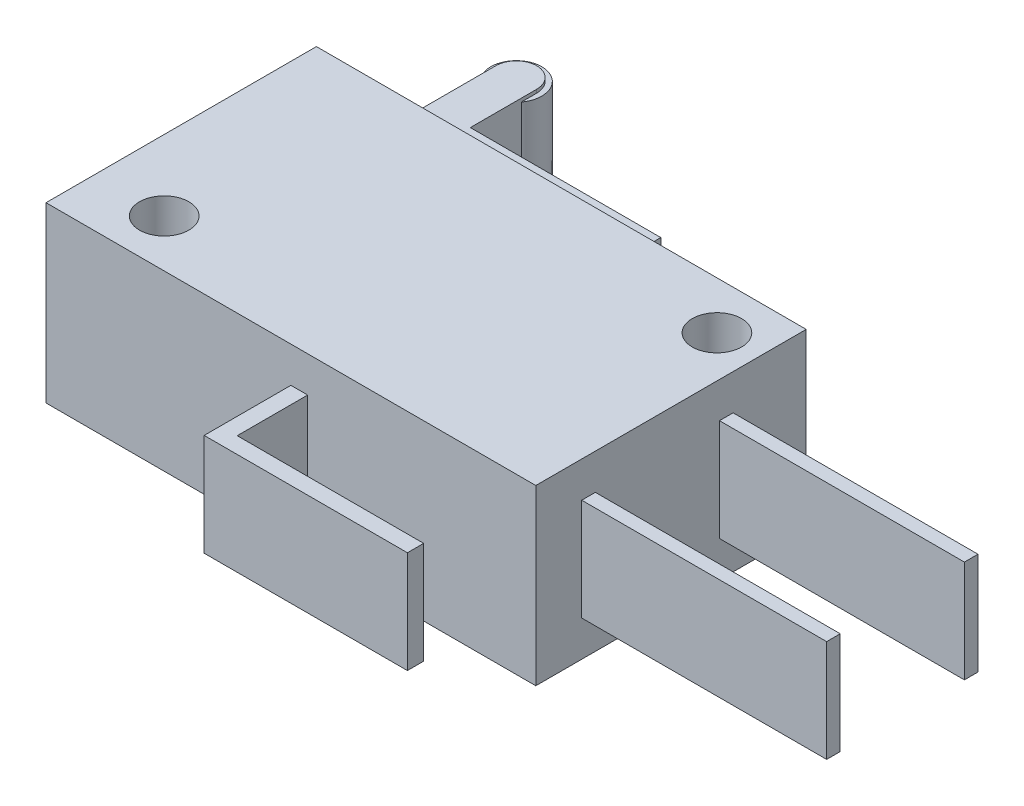
ISO-10303-21;
HEADER;
FILE_DESCRIPTION(('STEP AP214'),'2;1');
FILE_NAME('part.step','',(''),(''),'','','');
FILE_SCHEMA(('AUTOMOTIVE_DESIGN { 1 0 10303 214 1 1 1 1 }'));
ENDSEC;
DATA;
#1=APPLICATION_CONTEXT('core data for automotive mechanical design processes');
#2=APPLICATION_PROTOCOL_DEFINITION('international standard','automotive_design',2000,#1);
#3=PRODUCT_CONTEXT('',#1,'mechanical');
#4=PRODUCT('Part','Part','',(#3));
#5=PRODUCT_RELATED_PRODUCT_CATEGORY('part','',(#4));
#6=PRODUCT_DEFINITION_FORMATION('','',#4);
#7=PRODUCT_DEFINITION_CONTEXT('part definition',#1,'design');
#8=PRODUCT_DEFINITION('design','',#6,#7);
#9=PRODUCT_DEFINITION_SHAPE('','',#8);
#10=(LENGTH_UNIT() NAMED_UNIT(*) SI_UNIT(.MILLI.,.METRE.));
#11=(NAMED_UNIT(*) PLANE_ANGLE_UNIT() SI_UNIT($,.RADIAN.));
#12=(NAMED_UNIT(*) SI_UNIT($,.STERADIAN.) SOLID_ANGLE_UNIT());
#13=UNCERTAINTY_MEASURE_WITH_UNIT(LENGTH_MEASURE(1.E-05),#10,'distance_accuracy_value','');
#14=(GEOMETRIC_REPRESENTATION_CONTEXT(3) GLOBAL_UNCERTAINTY_ASSIGNED_CONTEXT((#13)) GLOBAL_UNIT_ASSIGNED_CONTEXT((#10,
#11,#12)) REPRESENTATION_CONTEXT('',''));
#15=CARTESIAN_POINT('',(0.,0.,0.));
#16=DIRECTION('',(0.,0.,1.));
#17=DIRECTION('',(1.,0.,0.));
#18=AXIS2_PLACEMENT_3D('',#15,#16,#17);
#19=CARTESIAN_POINT('',(-14.4,10.2,7.95));
#20=DIRECTION('',(0.,0.,-1.));
#21=DIRECTION('',(-1.,0.,0.));
#22=AXIS2_PLACEMENT_3D('',#19,#20,#21);
#23=PLANE('',#22);
#24=DIRECTION('',(1.,0.,0.));
#25=VECTOR('',#24,1.);
#26=CARTESIAN_POINT('',(-14.4,0.,7.95));
#27=LINE('',#26,#25);
#28=CARTESIAN_POINT('',(-14.4,0.,7.95));
#29=VERTEX_POINT('',#28);
#30=CARTESIAN_POINT('',(14.4,0.,7.95));
#31=VERTEX_POINT('',#30);
#32=EDGE_CURVE('E461',#29,#31,#27,.T.);
#33=ORIENTED_EDGE('',*,*,#32,.T.);
#34=DIRECTION('',(0.,-1.,0.));
#35=VECTOR('',#34,1.);
#36=CARTESIAN_POINT('',(14.4,10.2,7.95));
#37=LINE('',#36,#35);
#38=CARTESIAN_POINT('',(14.4,10.2,7.95));
#39=VERTEX_POINT('',#38);
#40=EDGE_CURVE('E470',#39,#31,#37,.T.);
#41=ORIENTED_EDGE('',*,*,#40,.F.);
#42=DIRECTION('',(1.,0.,0.));
#43=VECTOR('',#42,1.);
#44=CARTESIAN_POINT('',(-14.4,10.2,7.95));
#45=LINE('',#44,#43);
#46=CARTESIAN_POINT('',(-14.4,10.2,7.95));
#47=VERTEX_POINT('',#46);
#48=EDGE_CURVE('E448',#47,#39,#45,.T.);
#49=ORIENTED_EDGE('',*,*,#48,.F.);
#50=DIRECTION('',(0.,-1.,0.));
#51=VECTOR('',#50,1.);
#52=CARTESIAN_POINT('',(-14.4,10.2,7.95));
#53=LINE('',#52,#51);
#54=EDGE_CURVE('E468',#47,#29,#53,.T.);
#55=ORIENTED_EDGE('',*,*,#54,.T.);
#56=EDGE_LOOP('',(#33,#41,#49,#55));
#57=FACE_BOUND('',#56,.T.);
#58=DIRECTION('',(-1.,0.,0.));
#59=VECTOR('',#58,1.);
#60=CARTESIAN_POINT('',(0.986707235621526,2.1,7.95));
#61=LINE('',#60,#59);
#62=CARTESIAN_POINT('',(0.986707235621526,2.1,7.95));
#63=VERTEX_POINT('',#62);
#64=CARTESIAN_POINT('',(0.,2.1,7.95));
#65=VERTEX_POINT('',#64);
#66=EDGE_CURVE('E272',#63,#65,#61,.T.);
#67=ORIENTED_EDGE('',*,*,#66,.T.);
#68=DIRECTION('',(0.,1.,0.));
#69=VECTOR('',#68,1.);
#70=CARTESIAN_POINT('',(0.,2.1,7.95));
#71=LINE('',#70,#69);
#72=CARTESIAN_POINT('',(0.,8.1,7.95));
#73=VERTEX_POINT('',#72);
#74=EDGE_CURVE('E285',#65,#73,#71,.T.);
#75=ORIENTED_EDGE('',*,*,#74,.T.);
#76=DIRECTION('',(-1.,0.,0.));
#77=VECTOR('',#76,1.);
#78=CARTESIAN_POINT('',(0.986707235621526,8.1,7.95));
#79=LINE('',#78,#77);
#80=CARTESIAN_POINT('',(0.986707235621526,8.1,7.95));
#81=VERTEX_POINT('',#80);
#82=EDGE_CURVE('E261',#81,#73,#79,.T.);
#83=ORIENTED_EDGE('',*,*,#82,.F.);
#84=DIRECTION('',(0.,1.,0.));
#85=VECTOR('',#84,1.);
#86=CARTESIAN_POINT('',(0.986707235621526,2.1,7.95));
#87=LINE('',#86,#85);
#88=EDGE_CURVE('E288',#63,#81,#87,.T.);
#89=ORIENTED_EDGE('',*,*,#88,.F.);
#90=EDGE_LOOP('',(#67,#75,#83,#89));
#91=FACE_BOUND('',#90,.T.);
#92=ADVANCED_FACE('F37',(#57,#91),#23,.F.);
#93=CARTESIAN_POINT('',(14.4,10.2,7.95));
#94=DIRECTION('',(-1.,0.,0.));
#95=DIRECTION('',(0.,0.,1.));
#96=AXIS2_PLACEMENT_3D('',#93,#94,#95);
#97=PLANE('',#96);
#98=DIRECTION('',(0.,0.,-1.));
#99=VECTOR('',#98,1.);
#100=CARTESIAN_POINT('',(14.4,0.,7.95));
#101=LINE('',#100,#99);
#102=CARTESIAN_POINT('',(14.4,0.,-7.95));
#103=VERTEX_POINT('',#102);
#104=EDGE_CURVE('E457',#31,#103,#101,.T.);
#105=ORIENTED_EDGE('',*,*,#104,.T.);
#106=DIRECTION('',(0.,-1.,0.));
#107=VECTOR('',#106,1.);
#108=CARTESIAN_POINT('',(14.4,10.2,-7.95));
#109=LINE('',#108,#107);
#110=CARTESIAN_POINT('',(14.4,10.2,-7.95));
#111=VERTEX_POINT('',#110);
#112=EDGE_CURVE('E453',#111,#103,#109,.T.);
#113=ORIENTED_EDGE('',*,*,#112,.F.);
#114=DIRECTION('',(0.,0.,-1.));
#115=VECTOR('',#114,1.);
#116=CARTESIAN_POINT('',(14.4,10.2,7.95));
#117=LINE('',#116,#115);
#118=EDGE_CURVE('E445',#39,#111,#117,.T.);
#119=ORIENTED_EDGE('',*,*,#118,.F.);
#120=ORIENTED_EDGE('',*,*,#40,.T.);
#121=EDGE_LOOP('',(#105,#113,#119,#120));
#122=FACE_BOUND('',#121,.T.);
#123=DIRECTION('',(0.,1.,0.));
#124=VECTOR('',#123,1.);
#125=CARTESIAN_POINT('',(14.4,2.1,-3.65));
#126=LINE('',#125,#124);
#127=CARTESIAN_POINT('',(14.4,2.1,-3.65));
#128=VERTEX_POINT('',#127);
#129=CARTESIAN_POINT('',(14.4,8.1,-3.65));
#130=VERTEX_POINT('',#129);
#131=EDGE_CURVE('E343',#128,#130,#126,.T.);
#132=ORIENTED_EDGE('',*,*,#131,.F.);
#133=DIRECTION('',(0.,0.,1.));
#134=VECTOR('',#133,1.);
#135=CARTESIAN_POINT('',(14.4,2.1,-2.85));
#136=LINE('',#135,#134);
#137=CARTESIAN_POINT('',(14.4,2.1,-2.85));
#138=VERTEX_POINT('',#137);
#139=EDGE_CURVE('E331',#128,#138,#136,.T.);
#140=ORIENTED_EDGE('',*,*,#139,.T.);
#141=DIRECTION('',(0.,1.,0.));
#142=VECTOR('',#141,1.);
#143=CARTESIAN_POINT('',(14.4,2.1,-2.85));
#144=LINE('',#143,#142);
#145=CARTESIAN_POINT('',(14.4,8.1,-2.85));
#146=VERTEX_POINT('',#145);
#147=EDGE_CURVE('E342',#138,#146,#144,.T.);
#148=ORIENTED_EDGE('',*,*,#147,.T.);
#149=DIRECTION('',(0.,0.,1.));
#150=VECTOR('',#149,1.);
#151=CARTESIAN_POINT('',(14.4,8.1,-2.85));
#152=LINE('',#151,#150);
#153=EDGE_CURVE('E313',#130,#146,#152,.T.);
#154=ORIENTED_EDGE('',*,*,#153,.F.);
#155=EDGE_LOOP('',(#132,#140,#148,#154));
#156=FACE_BOUND('',#155,.T.);
#157=DIRECTION('',(0.,0.,1.));
#158=VECTOR('',#157,1.);
#159=CARTESIAN_POINT('',(14.4,2.1,4.45));
#160=LINE('',#159,#158);
#161=CARTESIAN_POINT('',(14.4,2.1,4.45));
#162=VERTEX_POINT('',#161);
#163=CARTESIAN_POINT('',(14.4,2.1,5.25));
#164=VERTEX_POINT('',#163);
#165=EDGE_CURVE('E298',#162,#164,#160,.T.);
#166=ORIENTED_EDGE('',*,*,#165,.T.);
#167=DIRECTION('',(0.,1.,0.));
#168=VECTOR('',#167,1.);
#169=CARTESIAN_POINT('',(14.4,2.1,5.25));
#170=LINE('',#169,#168);
#171=CARTESIAN_POINT('',(14.4,8.1,5.25));
#172=VERTEX_POINT('',#171);
#173=EDGE_CURVE('E310',#164,#172,#170,.T.);
#174=ORIENTED_EDGE('',*,*,#173,.T.);
#175=DIRECTION('',(0.,0.,1.));
#176=VECTOR('',#175,1.);
#177=CARTESIAN_POINT('',(14.4,8.1,4.45));
#178=LINE('',#177,#176);
#179=CARTESIAN_POINT('',(14.4,8.1,4.45));
#180=VERTEX_POINT('',#179);
#181=EDGE_CURVE('E282',#180,#172,#178,.T.);
#182=ORIENTED_EDGE('',*,*,#181,.F.);
#183=DIRECTION('',(0.,1.,0.));
#184=VECTOR('',#183,1.);
#185=CARTESIAN_POINT('',(14.4,2.1,4.45));
#186=LINE('',#185,#184);
#187=EDGE_CURVE('E311',#162,#180,#186,.T.);
#188=ORIENTED_EDGE('',*,*,#187,.F.);
#189=EDGE_LOOP('',(#166,#174,#182,#188));
#190=FACE_BOUND('',#189,.T.);
#191=ADVANCED_FACE('F542',(#122,#156,#190),#97,.F.);
#192=CARTESIAN_POINT('',(-8.65,1.7,-13.95));
#193=DIRECTION('',(0.,1.,0.));
#194=DIRECTION('',(0.,0.,1.));
#195=AXIS2_PLACEMENT_3D('',#192,#193,#194);
#196=CYLINDRICAL_SURFACE('',#195,1.2);
#197=DIRECTION('',(0.,1.,0.));
#198=VECTOR('',#197,1.);
#199=CARTESIAN_POINT('',(-9.85,1.7,-13.95));
#200=LINE('',#199,#198);
#201=CARTESIAN_POINT('',(-9.85,1.7,-13.95));
#202=VERTEX_POINT('',#201);
#203=CARTESIAN_POINT('',(-9.85,1.9,-13.95));
#204=VERTEX_POINT('',#203);
#205=EDGE_CURVE('E429',#202,#204,#200,.T.);
#206=ORIENTED_EDGE('',*,*,#205,.T.);
#207=CARTESIAN_POINT('',(-8.65,1.9,-13.95));
#208=DIRECTION('',(0.,1.,0.));
#209=DIRECTION('',(0.,0.,1.));
#210=AXIS2_PLACEMENT_3D('',#207,#208,#209);
#211=CIRCLE('',#210,1.2);
#212=CARTESIAN_POINT('',(-7.45,1.9,-13.95));
#213=VERTEX_POINT('',#212);
#214=EDGE_CURVE('E467',#204,#213,#211,.F.);
#215=ORIENTED_EDGE('',*,*,#214,.T.);
#216=DIRECTION('',(0.,1.,0.));
#217=VECTOR('',#216,1.);
#218=CARTESIAN_POINT('',(-7.45,1.7,-13.95));
#219=LINE('',#218,#217);
#220=CARTESIAN_POINT('',(-7.45,1.7,-13.95));
#221=VERTEX_POINT('',#220);
#222=EDGE_CURVE('E433',#221,#213,#219,.T.);
#223=ORIENTED_EDGE('',*,*,#222,.F.);
#224=CARTESIAN_POINT('',(-8.65,1.7,-13.95));
#225=DIRECTION('',(0.,1.,0.));
#226=DIRECTION('',(0.,0.,1.));
#227=AXIS2_PLACEMENT_3D('',#224,#225,#226);
#228=CIRCLE('',#227,1.2);
#229=EDGE_CURVE('E395',#221,#202,#228,.T.);
#230=ORIENTED_EDGE('',*,*,#229,.T.);
#231=EDGE_LOOP('',(#206,#215,#223,#230));
#232=FACE_BOUND('',#231,.T.);
#233=ADVANCED_FACE('F510',(#232),#196,.T.);
#234=CARTESIAN_POINT('',(-14.4,10.2,-7.95));
#235=DIRECTION('',(0.,0.,-1.));
#236=DIRECTION('',(-1.,0.,0.));
#237=AXIS2_PLACEMENT_3D('',#234,#235,#236);
#238=PLANE('',#237);
#239=DIRECTION('',(1.,0.,0.));
#240=VECTOR('',#239,1.);
#241=CARTESIAN_POINT('',(-14.4,0.,-7.95));
#242=LINE('',#241,#240);
#243=CARTESIAN_POINT('',(-14.4,0.,-7.95));
#244=VERTEX_POINT('',#243);
#245=EDGE_CURVE('E454',#244,#103,#242,.T.);
#246=ORIENTED_EDGE('',*,*,#245,.F.);
#247=DIRECTION('',(0.,-1.,0.));
#248=VECTOR('',#247,1.);
#249=CARTESIAN_POINT('',(-14.4,10.2,-7.95));
#250=LINE('',#249,#248);
#251=CARTESIAN_POINT('',(-14.4,10.2,-7.95));
#252=VERTEX_POINT('',#251);
#253=EDGE_CURVE('E465',#252,#244,#250,.T.);
#254=ORIENTED_EDGE('',*,*,#253,.F.);
#255=DIRECTION('',(1.,0.,0.));
#256=VECTOR('',#255,1.);
#257=CARTESIAN_POINT('',(-14.4,10.2,-7.95));
#258=LINE('',#257,#256);
#259=EDGE_CURVE('E442',#252,#111,#258,.T.);
#260=ORIENTED_EDGE('',*,*,#259,.T.);
#261=ORIENTED_EDGE('',*,*,#112,.T.);
#262=EDGE_LOOP('',(#246,#254,#260,#261));
#263=FACE_BOUND('',#262,.T.);
#264=DIRECTION('',(0.,1.,0.));
#265=VECTOR('',#264,1.);
#266=CARTESIAN_POINT('',(3.23890030456619,1.7,-7.95));
#267=LINE('',#266,#265);
#268=CARTESIAN_POINT('',(3.23890030456619,1.7,-7.95));
#269=VERTEX_POINT('',#268);
#270=CARTESIAN_POINT('',(3.23890030456619,8.5,-7.95));
#271=VERTEX_POINT('',#270);
#272=EDGE_CURVE('E422',#269,#271,#267,.T.);
#273=ORIENTED_EDGE('',*,*,#272,.F.);
#274=DIRECTION('',(-1.,0.,0.));
#275=VECTOR('',#274,1.);
#276=CARTESIAN_POINT('',(0.,1.7,-7.95));
#277=LINE('',#276,#275);
#278=CARTESIAN_POINT('',(3.75,1.7,-7.95));
#279=VERTEX_POINT('',#278);
#280=EDGE_CURVE('E406',#279,#269,#277,.T.);
#281=ORIENTED_EDGE('',*,*,#280,.F.);
#282=DIRECTION('',(0.,1.,0.));
#283=VECTOR('',#282,1.);
#284=CARTESIAN_POINT('',(3.75,1.7,-7.95));
#285=LINE('',#284,#283);
#286=CARTESIAN_POINT('',(3.75,8.5,-7.95));
#287=VERTEX_POINT('',#286);
#288=EDGE_CURVE('E420',#279,#287,#285,.T.);
#289=ORIENTED_EDGE('',*,*,#288,.T.);
#290=DIRECTION('',(-1.,0.,0.));
#291=VECTOR('',#290,1.);
#292=CARTESIAN_POINT('',(0.,8.5,-7.95));
#293=LINE('',#292,#291);
#294=EDGE_CURVE('E384',#287,#271,#293,.T.);
#295=ORIENTED_EDGE('',*,*,#294,.T.);
#296=EDGE_LOOP('',(#273,#281,#289,#295));
#297=FACE_BOUND('',#296,.T.);
#298=ADVANCED_FACE('F39',(#263,#297),#238,.T.);
#299=CARTESIAN_POINT('',(-14.4,10.2,7.95));
#300=DIRECTION('',(-1.,0.,0.));
#301=DIRECTION('',(0.,0.,1.));
#302=AXIS2_PLACEMENT_3D('',#299,#300,#301);
#303=PLANE('',#302);
#304=DIRECTION('',(0.,0.,-1.));
#305=VECTOR('',#304,1.);
#306=CARTESIAN_POINT('',(-14.4,0.,7.95));
#307=LINE('',#306,#305);
#308=EDGE_CURVE('E446',#29,#244,#307,.T.);
#309=ORIENTED_EDGE('',*,*,#308,.F.);
#310=ORIENTED_EDGE('',*,*,#54,.F.);
#311=DIRECTION('',(0.,0.,-1.));
#312=VECTOR('',#311,1.);
#313=CARTESIAN_POINT('',(-14.4,10.2,7.95));
#314=LINE('',#313,#312);
#315=EDGE_CURVE('E450',#47,#252,#314,.T.);
#316=ORIENTED_EDGE('',*,*,#315,.T.);
#317=ORIENTED_EDGE('',*,*,#253,.T.);
#318=EDGE_LOOP('',(#309,#310,#316,#317));
#319=FACE_BOUND('',#318,.T.);
#320=ADVANCED_FACE('F533',(#319),#303,.T.);
#321=CARTESIAN_POINT('',(0.,10.2,0.));
#322=DIRECTION('',(0.,1.,0.));
#323=DIRECTION('',(0.,0.,1.));
#324=AXIS2_PLACEMENT_3D('',#321,#322,#323);
#325=PLANE('',#324);
#326=CARTESIAN_POINT('',(11.95,10.2,-5.15));
#327=DIRECTION('',(0.,1.,0.));
#328=DIRECTION('',(0.,0.,1.));
#329=AXIS2_PLACEMENT_3D('',#326,#327,#328);
#330=CIRCLE('',#329,1.45);
#331=CARTESIAN_POINT('',(11.95,10.2,-3.7));
#332=VERTEX_POINT('',#331);
#333=EDGE_CURVE('E436',#332,#332,#330,.T.);
#334=ORIENTED_EDGE('',*,*,#333,.F.);
#335=EDGE_LOOP('',(#334));
#336=FACE_BOUND('',#335,.T.);
#337=CARTESIAN_POINT('',(-10.25,10.2,5.15));
#338=DIRECTION('',(0.,1.,0.));
#339=DIRECTION('',(0.,0.,1.));
#340=AXIS2_PLACEMENT_3D('',#337,#338,#339);
#341=CIRCLE('',#340,1.45);
#342=CARTESIAN_POINT('',(-10.25,10.2,6.6));
#343=VERTEX_POINT('',#342);
#344=EDGE_CURVE('E417',#343,#343,#341,.T.);
#345=ORIENTED_EDGE('',*,*,#344,.F.);
#346=EDGE_LOOP('',(#345));
#347=FACE_BOUND('',#346,.T.);
#348=ORIENTED_EDGE('',*,*,#259,.F.);
#349=ORIENTED_EDGE('',*,*,#315,.F.);
#350=ORIENTED_EDGE('',*,*,#48,.T.);
#351=ORIENTED_EDGE('',*,*,#118,.T.);
#352=EDGE_LOOP('',(#348,#349,#350,#351));
#353=FACE_BOUND('',#352,.T.);
#354=ADVANCED_FACE('F539',(#336,#347,#353),#325,.T.);
#355=CARTESIAN_POINT('',(0.,0.,0.));
#356=DIRECTION('',(0.,1.,0.));
#357=DIRECTION('',(0.,0.,1.));
#358=AXIS2_PLACEMENT_3D('',#355,#356,#357);
#359=PLANE('',#358);
#360=CARTESIAN_POINT('',(11.95,0.,-5.15));
#361=DIRECTION('',(0.,1.,0.));
#362=DIRECTION('',(0.,0.,1.));
#363=AXIS2_PLACEMENT_3D('',#360,#361,#362);
#364=CIRCLE('',#363,1.45);
#365=CARTESIAN_POINT('',(11.95,0.,-3.7));
#366=VERTEX_POINT('',#365);
#367=EDGE_CURVE('E458',#366,#366,#364,.T.);
#368=ORIENTED_EDGE('',*,*,#367,.T.);
#369=EDGE_LOOP('',(#368));
#370=FACE_BOUND('',#369,.T.);
#371=CARTESIAN_POINT('',(-10.25,0.,5.15));
#372=DIRECTION('',(0.,1.,0.));
#373=DIRECTION('',(0.,0.,1.));
#374=AXIS2_PLACEMENT_3D('',#371,#372,#373);
#375=CIRCLE('',#374,1.45);
#376=CARTESIAN_POINT('',(-10.25,0.,6.6));
#377=VERTEX_POINT('',#376);
#378=EDGE_CURVE('E439',#377,#377,#375,.T.);
#379=ORIENTED_EDGE('',*,*,#378,.T.);
#380=EDGE_LOOP('',(#379));
#381=FACE_BOUND('',#380,.T.);
#382=ORIENTED_EDGE('',*,*,#245,.T.);
#383=ORIENTED_EDGE('',*,*,#104,.F.);
#384=ORIENTED_EDGE('',*,*,#32,.F.);
#385=ORIENTED_EDGE('',*,*,#308,.T.);
#386=EDGE_LOOP('',(#382,#383,#384,#385));
#387=FACE_BOUND('',#386,.T.);
#388=ADVANCED_FACE('F554',(#370,#381,#387),#359,.F.);
#389=CARTESIAN_POINT('',(-10.25,-7.25,5.15));
#390=DIRECTION('',(0.,1.,0.));
#391=DIRECTION('',(0.,0.,1.));
#392=AXIS2_PLACEMENT_3D('',#389,#390,#391);
#393=CYLINDRICAL_SURFACE('',#392,1.45);
#394=ORIENTED_EDGE('',*,*,#344,.T.);
#395=EDGE_LOOP('',(#394));
#396=FACE_BOUND('',#395,.T.);
#397=ORIENTED_EDGE('',*,*,#378,.F.);
#398=EDGE_LOOP('',(#397));
#399=FACE_BOUND('',#398,.T.);
#400=ADVANCED_FACE('F557',(#396,#399),#393,.F.);
#401=CARTESIAN_POINT('',(11.95,-7.25,-5.15));
#402=DIRECTION('',(0.,1.,0.));
#403=DIRECTION('',(0.,0.,1.));
#404=AXIS2_PLACEMENT_3D('',#401,#402,#403);
#405=CYLINDRICAL_SURFACE('',#404,1.45);
#406=ORIENTED_EDGE('',*,*,#333,.T.);
#407=EDGE_LOOP('',(#406));
#408=FACE_BOUND('',#407,.T.);
#409=ORIENTED_EDGE('',*,*,#367,.F.);
#410=EDGE_LOOP('',(#409));
#411=FACE_BOUND('',#410,.T.);
#412=ADVANCED_FACE('F564',(#408,#411),#405,.F.);
#413=CARTESIAN_POINT('',(-7.45,1.7,0.));
#414=DIRECTION('',(-1.,0.,0.));
#415=DIRECTION('',(0.,0.,1.));
#416=AXIS2_PLACEMENT_3D('',#413,#414,#415);
#417=PLANE('',#416);
#418=DIRECTION('',(0.,-1.,0.));
#419=VECTOR('',#418,1.);
#420=CARTESIAN_POINT('',(-7.45,8.3,-13.05));
#421=LINE('',#420,#419);
#422=CARTESIAN_POINT('',(-7.45,8.3,-13.05));
#423=VERTEX_POINT('',#422);
#424=CARTESIAN_POINT('',(-7.45,1.9,-13.05));
#425=VERTEX_POINT('',#424);
#426=EDGE_CURVE('E367',#423,#425,#421,.T.);
#427=ORIENTED_EDGE('',*,*,#426,.F.);
#428=DIRECTION('',(0.,0.,-1.));
#429=VECTOR('',#428,1.);
#430=CARTESIAN_POINT('',(-7.45,8.3,0.));
#431=LINE('',#430,#429);
#432=CARTESIAN_POINT('',(-7.45,8.3,-13.95));
#433=VERTEX_POINT('',#432);
#434=EDGE_CURVE('E364',#423,#433,#431,.T.);
#435=ORIENTED_EDGE('',*,*,#434,.T.);
#436=CARTESIAN_POINT('',(-7.45,8.5,-13.95));
#437=VERTEX_POINT('',#436);
#438=EDGE_CURVE('E414',#433,#437,#219,.T.);
#439=ORIENTED_EDGE('',*,*,#438,.T.);
#440=DIRECTION('',(0.,0.,1.));
#441=VECTOR('',#440,1.);
#442=CARTESIAN_POINT('',(-7.45,8.5,0.));
#443=LINE('',#442,#441);
#444=CARTESIAN_POINT('',(-7.45,8.5,-10.05));
#445=VERTEX_POINT('',#444);
#446=EDGE_CURVE('E369',#437,#445,#443,.T.);
#447=ORIENTED_EDGE('',*,*,#446,.T.);
#448=DIRECTION('',(0.,1.,0.));
#449=VECTOR('',#448,1.);
#450=CARTESIAN_POINT('',(-7.45,1.7,-10.05));
#451=LINE('',#450,#449);
#452=CARTESIAN_POINT('',(-7.45,1.7,-10.05));
#453=VERTEX_POINT('',#452);
#454=EDGE_CURVE('E415',#453,#445,#451,.T.);
#455=ORIENTED_EDGE('',*,*,#454,.F.);
#456=DIRECTION('',(0.,0.,1.));
#457=VECTOR('',#456,1.);
#458=CARTESIAN_POINT('',(-7.45,1.7,0.));
#459=LINE('',#458,#457);
#460=EDGE_CURVE('E392',#221,#453,#459,.T.);
#461=ORIENTED_EDGE('',*,*,#460,.F.);
#462=ORIENTED_EDGE('',*,*,#222,.T.);
#463=DIRECTION('',(0.,0.,-1.));
#464=VECTOR('',#463,1.);
#465=CARTESIAN_POINT('',(-7.45,1.9,0.));
#466=LINE('',#465,#464);
#467=EDGE_CURVE('E360',#425,#213,#466,.T.);
#468=ORIENTED_EDGE('',*,*,#467,.F.);
#469=EDGE_LOOP('',(#427,#435,#439,#447,#455,#461,#462,#468));
#470=FACE_BOUND('',#469,.T.);
#471=ADVANCED_FACE('F489',(#470),#417,.F.);
#472=CARTESIAN_POINT('',(0.,1.7,-10.05));
#473=DIRECTION('',(0.,0.,1.));
#474=DIRECTION('',(1.,0.,0.));
#475=AXIS2_PLACEMENT_3D('',#472,#473,#474);
#476=PLANE('',#475);
#477=ORIENTED_EDGE('',*,*,#454,.T.);
#478=DIRECTION('',(1.,0.,0.));
#479=VECTOR('',#478,1.);
#480=CARTESIAN_POINT('',(0.,8.5,-10.05));
#481=LINE('',#480,#479);
#482=CARTESIAN_POINT('',(3.75,8.5,-10.05));
#483=VERTEX_POINT('',#482);
#484=EDGE_CURVE('E389',#445,#483,#481,.T.);
#485=ORIENTED_EDGE('',*,*,#484,.T.);
#486=DIRECTION('',(0.,1.,0.));
#487=VECTOR('',#486,1.);
#488=CARTESIAN_POINT('',(3.75,1.7,-10.05));
#489=LINE('',#488,#487);
#490=CARTESIAN_POINT('',(3.75,1.7,-10.05));
#491=VERTEX_POINT('',#490);
#492=EDGE_CURVE('E418',#491,#483,#489,.T.);
#493=ORIENTED_EDGE('',*,*,#492,.F.);
#494=DIRECTION('',(1.,0.,0.));
#495=VECTOR('',#494,1.);
#496=CARTESIAN_POINT('',(0.,1.7,-10.05));
#497=LINE('',#496,#495);
#498=EDGE_CURVE('E412',#453,#491,#497,.T.);
#499=ORIENTED_EDGE('',*,*,#498,.F.);
#500=EDGE_LOOP('',(#477,#485,#493,#499));
#501=FACE_BOUND('',#500,.T.);
#502=ADVANCED_FACE('F503',(#501),#476,.F.);
#503=CARTESIAN_POINT('',(3.75,1.7,0.));
#504=DIRECTION('',(-1.,0.,0.));
#505=DIRECTION('',(0.,0.,1.));
#506=AXIS2_PLACEMENT_3D('',#503,#504,#505);
#507=PLANE('',#506);
#508=ORIENTED_EDGE('',*,*,#492,.T.);
#509=DIRECTION('',(0.,0.,1.));
#510=VECTOR('',#509,1.);
#511=CARTESIAN_POINT('',(3.75,8.5,0.));
#512=LINE('',#511,#510);
#513=EDGE_CURVE('E386',#483,#287,#512,.T.);
#514=ORIENTED_EDGE('',*,*,#513,.T.);
#515=ORIENTED_EDGE('',*,*,#288,.F.);
#516=DIRECTION('',(0.,0.,1.));
#517=VECTOR('',#516,1.);
#518=CARTESIAN_POINT('',(3.75,1.7,0.));
#519=LINE('',#518,#517);
#520=EDGE_CURVE('E409',#491,#279,#519,.T.);
#521=ORIENTED_EDGE('',*,*,#520,.F.);
#522=EDGE_LOOP('',(#508,#514,#515,#521));
#523=FACE_BOUND('',#522,.T.);
#524=ADVANCED_FACE('F531',(#523),#507,.F.);
#525=CARTESIAN_POINT('',(3.2389003045662,1.7,0.));
#526=DIRECTION('',(-1.,0.,0.));
#527=DIRECTION('',(0.,0.,1.));
#528=AXIS2_PLACEMENT_3D('',#525,#526,#527);
#529=PLANE('',#528);
#530=ORIENTED_EDGE('',*,*,#272,.T.);
#531=DIRECTION('',(0.,0.,1.));
#532=VECTOR('',#531,1.);
#533=CARTESIAN_POINT('',(3.2389003045662,8.5,0.));
#534=LINE('',#533,#532);
#535=CARTESIAN_POINT('',(3.23890030456619,8.5,-9.64893386783168));
#536=VERTEX_POINT('',#535);
#537=EDGE_CURVE('E381',#536,#271,#534,.T.);
#538=ORIENTED_EDGE('',*,*,#537,.F.);
#539=DIRECTION('',(0.,1.,0.));
#540=VECTOR('',#539,1.);
#541=CARTESIAN_POINT('',(3.23890030456619,1.7,-9.64893386783168));
#542=LINE('',#541,#540);
#543=CARTESIAN_POINT('',(3.23890030456619,1.7,-9.64893386783168));
#544=VERTEX_POINT('',#543);
#545=EDGE_CURVE('E425',#544,#536,#542,.T.);
#546=ORIENTED_EDGE('',*,*,#545,.F.);
#547=DIRECTION('',(0.,0.,1.));
#548=VECTOR('',#547,1.);
#549=CARTESIAN_POINT('',(3.2389003045662,1.7,0.));
#550=LINE('',#549,#548);
#551=EDGE_CURVE('E403',#544,#269,#550,.T.);
#552=ORIENTED_EDGE('',*,*,#551,.T.);
#553=EDGE_LOOP('',(#530,#538,#546,#552));
#554=FACE_BOUND('',#553,.T.);
#555=ADVANCED_FACE('F526',(#554),#529,.T.);
#556=CARTESIAN_POINT('',(0.,1.7,-9.64893386783168));
#557=DIRECTION('',(0.,0.,-1.));
#558=DIRECTION('',(-1.,0.,0.));
#559=AXIS2_PLACEMENT_3D('',#556,#557,#558);
#560=PLANE('',#559);
#561=ORIENTED_EDGE('',*,*,#545,.T.);
#562=DIRECTION('',(-1.,0.,0.));
#563=VECTOR('',#562,1.);
#564=CARTESIAN_POINT('',(0.,8.5,-9.64893386783168));
#565=LINE('',#564,#563);
#566=CARTESIAN_POINT('',(-9.85,8.5,-9.64893386783168));
#567=VERTEX_POINT('',#566);
#568=EDGE_CURVE('E378',#536,#567,#565,.T.);
#569=ORIENTED_EDGE('',*,*,#568,.T.);
#570=DIRECTION('',(0.,1.,0.));
#571=VECTOR('',#570,1.);
#572=CARTESIAN_POINT('',(-9.85,1.7,-9.64893386783168));
#573=LINE('',#572,#571);
#574=CARTESIAN_POINT('',(-9.85,1.7,-9.64893386783168));
#575=VERTEX_POINT('',#574);
#576=EDGE_CURVE('E427',#575,#567,#573,.T.);
#577=ORIENTED_EDGE('',*,*,#576,.F.);
#578=DIRECTION('',(-1.,0.,0.));
#579=VECTOR('',#578,1.);
#580=CARTESIAN_POINT('',(0.,1.7,-9.64893386783168));
#581=LINE('',#580,#579);
#582=EDGE_CURVE('E401',#544,#575,#581,.T.);
#583=ORIENTED_EDGE('',*,*,#582,.F.);
#584=EDGE_LOOP('',(#561,#569,#577,#583));
#585=FACE_BOUND('',#584,.T.);
#586=ADVANCED_FACE('F521',(#585),#560,.F.);
#587=CARTESIAN_POINT('',(-9.85,1.7,0.));
#588=DIRECTION('',(-1.,0.,0.));
#589=DIRECTION('',(0.,0.,1.));
#590=AXIS2_PLACEMENT_3D('',#587,#588,#589);
#591=PLANE('',#590);
#592=DIRECTION('',(0.,0.,-1.));
#593=VECTOR('',#592,1.);
#594=CARTESIAN_POINT('',(-9.85,8.3,0.));
#595=LINE('',#594,#593);
#596=CARTESIAN_POINT('',(-9.85,8.3,-13.05));
#597=VERTEX_POINT('',#596);
#598=CARTESIAN_POINT('',(-9.85,8.3,-13.95));
#599=VERTEX_POINT('',#598);
#600=EDGE_CURVE('E362',#597,#599,#595,.T.);
#601=ORIENTED_EDGE('',*,*,#600,.F.);
#602=DIRECTION('',(0.,-1.,0.));
#603=VECTOR('',#602,1.);
#604=CARTESIAN_POINT('',(-9.85,8.3,-13.05));
#605=LINE('',#604,#603);
#606=CARTESIAN_POINT('',(-9.85,1.9,-13.05));
#607=VERTEX_POINT('',#606);
#608=EDGE_CURVE('E11',#597,#607,#605,.T.);
#609=ORIENTED_EDGE('',*,*,#608,.T.);
#610=DIRECTION('',(0.,0.,-1.));
#611=VECTOR('',#610,1.);
#612=CARTESIAN_POINT('',(-9.85,1.9,0.));
#613=LINE('',#612,#611);
#614=EDGE_CURVE('E357',#607,#204,#613,.T.);
#615=ORIENTED_EDGE('',*,*,#614,.T.);
#616=ORIENTED_EDGE('',*,*,#205,.F.);
#617=DIRECTION('',(0.,0.,1.));
#618=VECTOR('',#617,1.);
#619=CARTESIAN_POINT('',(-9.85,1.7,0.));
#620=LINE('',#619,#618);
#621=EDGE_CURVE('E398',#202,#575,#620,.T.);
#622=ORIENTED_EDGE('',*,*,#621,.T.);
#623=ORIENTED_EDGE('',*,*,#576,.T.);
#624=DIRECTION('',(0.,0.,1.));
#625=VECTOR('',#624,1.);
#626=CARTESIAN_POINT('',(-9.85,8.5,0.));
#627=LINE('',#626,#625);
#628=CARTESIAN_POINT('',(-9.85,8.5,-13.95));
#629=VERTEX_POINT('',#628);
#630=EDGE_CURVE('E375',#629,#567,#627,.T.);
#631=ORIENTED_EDGE('',*,*,#630,.F.);
#632=EDGE_CURVE('E432',#599,#629,#200,.T.);
#633=ORIENTED_EDGE('',*,*,#632,.F.);
#634=EDGE_LOOP('',(#601,#609,#615,#616,#622,#623,#631,#633));
#635=FACE_BOUND('',#634,.T.);
#636=ADVANCED_FACE('F517',(#635),#591,.T.);
#637=CARTESIAN_POINT('',(-8.65,8.3,-13.95));
#638=DIRECTION('',(0.,1.,0.));
#639=DIRECTION('',(0.,0.,1.));
#640=AXIS2_PLACEMENT_3D('',#637,#638,#639);
#641=CIRCLE('',#640,1.2);
#642=EDGE_CURVE('E45',#599,#433,#641,.F.);
#643=ORIENTED_EDGE('',*,*,#642,.F.);
#644=ORIENTED_EDGE('',*,*,#632,.T.);
#645=CARTESIAN_POINT('',(-8.65,8.5,-13.95));
#646=DIRECTION('',(0.,1.,0.));
#647=DIRECTION('',(0.,0.,1.));
#648=AXIS2_PLACEMENT_3D('',#645,#646,#647);
#649=CIRCLE('',#648,1.2);
#650=EDGE_CURVE('E372',#437,#629,#649,.T.);
#651=ORIENTED_EDGE('',*,*,#650,.F.);
#652=ORIENTED_EDGE('',*,*,#438,.F.);
#653=EDGE_LOOP('',(#643,#644,#651,#652));
#654=FACE_BOUND('',#653,.T.);
#655=ADVANCED_FACE('F492',(#654),#196,.T.);
#656=CARTESIAN_POINT('',(0.,1.7,0.));
#657=DIRECTION('',(0.,1.,0.));
#658=DIRECTION('',(0.,0.,1.));
#659=AXIS2_PLACEMENT_3D('',#656,#657,#658);
#660=PLANE('',#659);
#661=ORIENTED_EDGE('',*,*,#460,.T.);
#662=ORIENTED_EDGE('',*,*,#498,.T.);
#663=ORIENTED_EDGE('',*,*,#520,.T.);
#664=ORIENTED_EDGE('',*,*,#280,.T.);
#665=ORIENTED_EDGE('',*,*,#551,.F.);
#666=ORIENTED_EDGE('',*,*,#582,.T.);
#667=ORIENTED_EDGE('',*,*,#621,.F.);
#668=ORIENTED_EDGE('',*,*,#229,.F.);
#669=EDGE_LOOP('',(#661,#662,#663,#664,#665,#666,#667,#668));
#670=FACE_BOUND('',#669,.T.);
#671=ADVANCED_FACE('F507',(#670),#660,.F.);
#672=CARTESIAN_POINT('',(0.,8.5,0.));
#673=DIRECTION('',(0.,1.,0.));
#674=DIRECTION('',(0.,0.,1.));
#675=AXIS2_PLACEMENT_3D('',#672,#673,#674);
#676=PLANE('',#675);
#677=ORIENTED_EDGE('',*,*,#446,.F.);
#678=ORIENTED_EDGE('',*,*,#650,.T.);
#679=ORIENTED_EDGE('',*,*,#630,.T.);
#680=ORIENTED_EDGE('',*,*,#568,.F.);
#681=ORIENTED_EDGE('',*,*,#537,.T.);
#682=ORIENTED_EDGE('',*,*,#294,.F.);
#683=ORIENTED_EDGE('',*,*,#513,.F.);
#684=ORIENTED_EDGE('',*,*,#484,.F.);
#685=EDGE_LOOP('',(#677,#678,#679,#680,#681,#682,#683,#684));
#686=FACE_BOUND('',#685,.T.);
#687=ADVANCED_FACE('F497',(#686),#676,.T.);
#688=CARTESIAN_POINT('',(-8.65,8.3,-13.95));
#689=DIRECTION('',(0.,-1.,0.));
#690=DIRECTION('',(0.,0.,-1.));
#691=AXIS2_PLACEMENT_3D('',#688,#689,#690);
#692=CYLINDRICAL_SURFACE('',#691,1.5);
#693=CARTESIAN_POINT('',(-8.65,8.3,-13.95));
#694=DIRECTION('',(0.,1.,0.));
#695=DIRECTION('',(0.,0.,1.));
#696=AXIS2_PLACEMENT_3D('',#693,#694,#695);
#697=CIRCLE('',#696,1.5);
#698=EDGE_CURVE('E354',#423,#597,#697,.T.);
#699=ORIENTED_EDGE('',*,*,#698,.F.);
#700=ORIENTED_EDGE('',*,*,#426,.T.);
#701=CARTESIAN_POINT('',(-8.65,1.9,-13.95));
#702=DIRECTION('',(0.,1.,0.));
#703=DIRECTION('',(0.,0.,1.));
#704=AXIS2_PLACEMENT_3D('',#701,#702,#703);
#705=CIRCLE('',#704,1.5);
#706=EDGE_CURVE('E346',#425,#607,#705,.T.);
#707=ORIENTED_EDGE('',*,*,#706,.T.);
#708=ORIENTED_EDGE('',*,*,#608,.F.);
#709=EDGE_LOOP('',(#699,#700,#707,#708));
#710=FACE_BOUND('',#709,.T.);
#711=ADVANCED_FACE('F515',(#710),#692,.T.);
#712=CARTESIAN_POINT('',(-8.65,8.3,-13.95));
#713=DIRECTION('',(0.,1.,0.));
#714=DIRECTION('',(0.,0.,1.));
#715=AXIS2_PLACEMENT_3D('',#712,#713,#714);
#716=PLANE('',#715);
#717=ORIENTED_EDGE('',*,*,#434,.F.);
#718=ORIENTED_EDGE('',*,*,#698,.T.);
#719=ORIENTED_EDGE('',*,*,#600,.T.);
#720=ORIENTED_EDGE('',*,*,#642,.T.);
#721=EDGE_LOOP('',(#717,#718,#719,#720));
#722=FACE_BOUND('',#721,.T.);
#723=ADVANCED_FACE('F481',(#722),#716,.T.);
#724=CARTESIAN_POINT('',(-8.65,1.9,-13.95));
#725=DIRECTION('',(0.,1.,0.));
#726=DIRECTION('',(0.,0.,1.));
#727=AXIS2_PLACEMENT_3D('',#724,#725,#726);
#728=PLANE('',#727);
#729=ORIENTED_EDGE('',*,*,#706,.F.);
#730=ORIENTED_EDGE('',*,*,#467,.T.);
#731=ORIENTED_EDGE('',*,*,#214,.F.);
#732=ORIENTED_EDGE('',*,*,#614,.F.);
#733=EDGE_LOOP('',(#729,#730,#731,#732));
#734=FACE_BOUND('',#733,.T.);
#735=ADVANCED_FACE('F513',(#734),#728,.F.);
#736=CARTESIAN_POINT('',(14.4,2.1,-3.65));
#737=DIRECTION('',(0.,0.,-1.));
#738=DIRECTION('',(-1.,0.,0.));
#739=AXIS2_PLACEMENT_3D('',#736,#737,#738);
#740=PLANE('',#739);
#741=ORIENTED_EDGE('',*,*,#131,.T.);
#742=DIRECTION('',(-1.,0.,0.));
#743=VECTOR('',#742,1.);
#744=CARTESIAN_POINT('',(14.4,8.1,-3.65));
#745=LINE('',#744,#743);
#746=CARTESIAN_POINT('',(28.8,8.1,-3.65));
#747=VERTEX_POINT('',#746);
#748=EDGE_CURVE('E328',#747,#130,#745,.T.);
#749=ORIENTED_EDGE('',*,*,#748,.F.);
#750=DIRECTION('',(0.,1.,0.));
#751=VECTOR('',#750,1.);
#752=CARTESIAN_POINT('',(28.8,2.1,-3.65));
#753=LINE('',#752,#751);
#754=CARTESIAN_POINT('',(28.8,2.1,-3.65));
#755=VERTEX_POINT('',#754);
#756=EDGE_CURVE('E347',#755,#747,#753,.T.);
#757=ORIENTED_EDGE('',*,*,#756,.F.);
#758=DIRECTION('',(-1.,0.,0.));
#759=VECTOR('',#758,1.);
#760=CARTESIAN_POINT('',(14.4,2.1,-3.65));
#761=LINE('',#760,#759);
#762=EDGE_CURVE('E339',#755,#128,#761,.T.);
#763=ORIENTED_EDGE('',*,*,#762,.T.);
#764=EDGE_LOOP('',(#741,#749,#757,#763));
#765=FACE_BOUND('',#764,.T.);
#766=ADVANCED_FACE('F592',(#765),#740,.T.);
#767=CARTESIAN_POINT('',(28.8,2.1,-2.85));
#768=DIRECTION('',(1.,0.,0.));
#769=DIRECTION('',(0.,0.,-1.));
#770=AXIS2_PLACEMENT_3D('',#767,#768,#769);
#771=PLANE('',#770);
#772=ORIENTED_EDGE('',*,*,#756,.T.);
#773=DIRECTION('',(0.,0.,-1.));
#774=VECTOR('',#773,1.);
#775=CARTESIAN_POINT('',(28.8,8.1,-2.85));
#776=LINE('',#775,#774);
#777=CARTESIAN_POINT('',(28.8,8.1,-2.85));
#778=VERTEX_POINT('',#777);
#779=EDGE_CURVE('E325',#778,#747,#776,.T.);
#780=ORIENTED_EDGE('',*,*,#779,.F.);
#781=DIRECTION('',(0.,1.,0.));
#782=VECTOR('',#781,1.);
#783=CARTESIAN_POINT('',(28.8,2.1,-2.85));
#784=LINE('',#783,#782);
#785=CARTESIAN_POINT('',(28.8,2.1,-2.85));
#786=VERTEX_POINT('',#785);
#787=EDGE_CURVE('E349',#786,#778,#784,.T.);
#788=ORIENTED_EDGE('',*,*,#787,.F.);
#789=DIRECTION('',(0.,0.,-1.));
#790=VECTOR('',#789,1.);
#791=CARTESIAN_POINT('',(28.8,2.1,-2.85));
#792=LINE('',#791,#790);
#793=EDGE_CURVE('E336',#786,#755,#792,.T.);
#794=ORIENTED_EDGE('',*,*,#793,.T.);
#795=EDGE_LOOP('',(#772,#780,#788,#794));
#796=FACE_BOUND('',#795,.T.);
#797=ADVANCED_FACE('F597',(#796),#771,.T.);
#798=CARTESIAN_POINT('',(14.4,2.1,-2.85));
#799=DIRECTION('',(0.,0.,1.));
#800=DIRECTION('',(1.,0.,0.));
#801=AXIS2_PLACEMENT_3D('',#798,#799,#800);
#802=PLANE('',#801);
#803=ORIENTED_EDGE('',*,*,#787,.T.);
#804=DIRECTION('',(1.,0.,0.));
#805=VECTOR('',#804,1.);
#806=CARTESIAN_POINT('',(14.4,8.1,-2.85));
#807=LINE('',#806,#805);
#808=EDGE_CURVE('E322',#146,#778,#807,.T.);
#809=ORIENTED_EDGE('',*,*,#808,.F.);
#810=ORIENTED_EDGE('',*,*,#147,.F.);
#811=DIRECTION('',(1.,0.,0.));
#812=VECTOR('',#811,1.);
#813=CARTESIAN_POINT('',(14.4,2.1,-2.85));
#814=LINE('',#813,#812);
#815=EDGE_CURVE('E333',#138,#786,#814,.T.);
#816=ORIENTED_EDGE('',*,*,#815,.T.);
#817=EDGE_LOOP('',(#803,#809,#810,#816));
#818=FACE_BOUND('',#817,.T.);
#819=ADVANCED_FACE('F593',(#818),#802,.T.);
#820=CARTESIAN_POINT('',(0.,2.1,0.));
#821=DIRECTION('',(0.,-1.,0.));
#822=DIRECTION('',(0.,0.,-1.));
#823=AXIS2_PLACEMENT_3D('',#820,#821,#822);
#824=PLANE('',#823);
#825=ORIENTED_EDGE('',*,*,#139,.F.);
#826=ORIENTED_EDGE('',*,*,#762,.F.);
#827=ORIENTED_EDGE('',*,*,#793,.F.);
#828=ORIENTED_EDGE('',*,*,#815,.F.);
#829=EDGE_LOOP('',(#825,#826,#827,#828));
#830=FACE_BOUND('',#829,.T.);
#831=ADVANCED_FACE('F596',(#830),#824,.T.);
#832=CARTESIAN_POINT('',(0.,8.1,0.));
#833=DIRECTION('',(0.,-1.,0.));
#834=DIRECTION('',(0.,0.,-1.));
#835=AXIS2_PLACEMENT_3D('',#832,#833,#834);
#836=PLANE('',#835);
#837=ORIENTED_EDGE('',*,*,#153,.T.);
#838=ORIENTED_EDGE('',*,*,#808,.T.);
#839=ORIENTED_EDGE('',*,*,#779,.T.);
#840=ORIENTED_EDGE('',*,*,#748,.T.);
#841=EDGE_LOOP('',(#837,#838,#839,#840));
#842=FACE_BOUND('',#841,.T.);
#843=ADVANCED_FACE('F607',(#842),#836,.F.);
#844=CARTESIAN_POINT('',(14.4,2.1,4.45));
#845=DIRECTION('',(0.,0.,-1.));
#846=DIRECTION('',(-1.,0.,0.));
#847=AXIS2_PLACEMENT_3D('',#844,#845,#846);
#848=PLANE('',#847);
#849=ORIENTED_EDGE('',*,*,#187,.T.);
#850=DIRECTION('',(-1.,0.,0.));
#851=VECTOR('',#850,1.);
#852=CARTESIAN_POINT('',(14.4,8.1,4.45));
#853=LINE('',#852,#851);
#854=CARTESIAN_POINT('',(28.8,8.1,4.45));
#855=VERTEX_POINT('',#854);
#856=EDGE_CURVE('E60',#855,#180,#853,.T.);
#857=ORIENTED_EDGE('',*,*,#856,.F.);
#858=DIRECTION('',(0.,1.,0.));
#859=VECTOR('',#858,1.);
#860=CARTESIAN_POINT('',(28.8,2.1,4.45));
#861=LINE('',#860,#859);
#862=CARTESIAN_POINT('',(28.8,2.1,4.45));
#863=VERTEX_POINT('',#862);
#864=EDGE_CURVE('E314',#863,#855,#861,.T.);
#865=ORIENTED_EDGE('',*,*,#864,.F.);
#866=DIRECTION('',(-1.,0.,0.));
#867=VECTOR('',#866,1.);
#868=CARTESIAN_POINT('',(14.4,2.1,4.45));
#869=LINE('',#868,#867);
#870=EDGE_CURVE('E307',#863,#162,#869,.T.);
#871=ORIENTED_EDGE('',*,*,#870,.T.);
#872=EDGE_LOOP('',(#849,#857,#865,#871));
#873=FACE_BOUND('',#872,.T.);
#874=ADVANCED_FACE('F611',(#873),#848,.T.);
#875=CARTESIAN_POINT('',(28.8,2.1,4.45));
#876=DIRECTION('',(1.,0.,0.));
#877=DIRECTION('',(0.,0.,-1.));
#878=AXIS2_PLACEMENT_3D('',#875,#876,#877);
#879=PLANE('',#878);
#880=ORIENTED_EDGE('',*,*,#864,.T.);
#881=DIRECTION('',(0.,0.,-1.));
#882=VECTOR('',#881,1.);
#883=CARTESIAN_POINT('',(28.8,8.1,4.45));
#884=LINE('',#883,#882);
#885=CARTESIAN_POINT('',(28.8,8.1,5.25));
#886=VERTEX_POINT('',#885);
#887=EDGE_CURVE('E295',#886,#855,#884,.T.);
#888=ORIENTED_EDGE('',*,*,#887,.F.);
#889=DIRECTION('',(0.,1.,0.));
#890=VECTOR('',#889,1.);
#891=CARTESIAN_POINT('',(28.8,2.1,5.25));
#892=LINE('',#891,#890);
#893=CARTESIAN_POINT('',(28.8,2.1,5.25));
#894=VERTEX_POINT('',#893);
#895=EDGE_CURVE('E316',#894,#886,#892,.T.);
#896=ORIENTED_EDGE('',*,*,#895,.F.);
#897=DIRECTION('',(0.,0.,-1.));
#898=VECTOR('',#897,1.);
#899=CARTESIAN_POINT('',(28.8,2.1,4.45));
#900=LINE('',#899,#898);
#901=EDGE_CURVE('E304',#894,#863,#900,.T.);
#902=ORIENTED_EDGE('',*,*,#901,.T.);
#903=EDGE_LOOP('',(#880,#888,#896,#902));
#904=FACE_BOUND('',#903,.T.);
#905=ADVANCED_FACE('F617',(#904),#879,.T.);
#906=CARTESIAN_POINT('',(14.4,2.1,5.25));
#907=DIRECTION('',(0.,0.,1.));
#908=DIRECTION('',(1.,0.,0.));
#909=AXIS2_PLACEMENT_3D('',#906,#907,#908);
#910=PLANE('',#909);
#911=ORIENTED_EDGE('',*,*,#895,.T.);
#912=DIRECTION('',(1.,0.,0.));
#913=VECTOR('',#912,1.);
#914=CARTESIAN_POINT('',(14.4,8.1,5.25));
#915=LINE('',#914,#913);
#916=EDGE_CURVE('E292',#172,#886,#915,.T.);
#917=ORIENTED_EDGE('',*,*,#916,.F.);
#918=ORIENTED_EDGE('',*,*,#173,.F.);
#919=DIRECTION('',(1.,0.,0.));
#920=VECTOR('',#919,1.);
#921=CARTESIAN_POINT('',(14.4,2.1,5.25));
#922=LINE('',#921,#920);
#923=EDGE_CURVE('E301',#164,#894,#922,.T.);
#924=ORIENTED_EDGE('',*,*,#923,.T.);
#925=EDGE_LOOP('',(#911,#917,#918,#924));
#926=FACE_BOUND('',#925,.T.);
#927=ADVANCED_FACE('F613',(#926),#910,.T.);
#928=CARTESIAN_POINT('',(0.,2.1,0.));
#929=DIRECTION('',(0.,1.,0.));
#930=DIRECTION('',(0.,0.,1.));
#931=AXIS2_PLACEMENT_3D('',#928,#929,#930);
#932=PLANE('',#931);
#933=ORIENTED_EDGE('',*,*,#165,.F.);
#934=ORIENTED_EDGE('',*,*,#870,.F.);
#935=ORIENTED_EDGE('',*,*,#901,.F.);
#936=ORIENTED_EDGE('',*,*,#923,.F.);
#937=EDGE_LOOP('',(#933,#934,#935,#936));
#938=FACE_BOUND('',#937,.T.);
#939=ADVANCED_FACE('F616',(#938),#932,.F.);
#940=CARTESIAN_POINT('',(0.,8.1,0.));
#941=DIRECTION('',(0.,1.,0.));
#942=DIRECTION('',(0.,0.,1.));
#943=AXIS2_PLACEMENT_3D('',#940,#941,#942);
#944=PLANE('',#943);
#945=ORIENTED_EDGE('',*,*,#181,.T.);
#946=ORIENTED_EDGE('',*,*,#916,.T.);
#947=ORIENTED_EDGE('',*,*,#887,.T.);
#948=ORIENTED_EDGE('',*,*,#856,.T.);
#949=EDGE_LOOP('',(#945,#946,#947,#948));
#950=FACE_BOUND('',#949,.T.);
#951=ADVANCED_FACE('F627',(#950),#944,.T.);
#952=CARTESIAN_POINT('',(11.95,2.1,13.05));
#953=DIRECTION('',(1.,0.,0.));
#954=DIRECTION('',(0.,0.,-1.));
#955=AXIS2_PLACEMENT_3D('',#952,#953,#954);
#956=PLANE('',#955);
#957=DIRECTION('',(0.,1.,0.));
#958=VECTOR('',#957,1.);
#959=CARTESIAN_POINT('',(11.95,2.1,12.0936990405513));
#960=LINE('',#959,#958);
#961=CARTESIAN_POINT('',(11.95,2.1,12.0936990405513));
#962=VERTEX_POINT('',#961);
#963=CARTESIAN_POINT('',(11.95,8.1,12.0936990405513));
#964=VERTEX_POINT('',#963);
#965=EDGE_CURVE('E237',#962,#964,#960,.T.);
#966=ORIENTED_EDGE('',*,*,#965,.T.);
#967=DIRECTION('',(0.,0.,-1.));
#968=VECTOR('',#967,1.);
#969=CARTESIAN_POINT('',(11.95,8.1,13.05));
#970=LINE('',#969,#968);
#971=CARTESIAN_POINT('',(11.95,8.1,13.05));
#972=VERTEX_POINT('',#971);
#973=EDGE_CURVE('E241',#972,#964,#970,.T.);
#974=ORIENTED_EDGE('',*,*,#973,.F.);
#975=DIRECTION('',(0.,1.,0.));
#976=VECTOR('',#975,1.);
#977=CARTESIAN_POINT('',(11.95,2.1,13.05));
#978=LINE('',#977,#976);
#979=CARTESIAN_POINT('',(11.95,2.1,13.05));
#980=VERTEX_POINT('',#979);
#981=EDGE_CURVE('E280',#980,#972,#978,.T.);
#982=ORIENTED_EDGE('',*,*,#981,.F.);
#983=DIRECTION('',(0.,0.,-1.));
#984=VECTOR('',#983,1.);
#985=CARTESIAN_POINT('',(11.95,2.1,13.05));
#986=LINE('',#985,#984);
#987=EDGE_CURVE('E243',#980,#962,#986,.T.);
#988=ORIENTED_EDGE('',*,*,#987,.T.);
#989=EDGE_LOOP('',(#966,#974,#982,#988));
#990=FACE_BOUND('',#989,.T.);
#991=ADVANCED_FACE('F239',(#990),#956,.T.);
#992=CARTESIAN_POINT('',(0.,2.1,13.05));
#993=DIRECTION('',(0.,0.,1.));
#994=DIRECTION('',(1.,0.,0.));
#995=AXIS2_PLACEMENT_3D('',#992,#993,#994);
#996=PLANE('',#995);
#997=ORIENTED_EDGE('',*,*,#981,.T.);
#998=DIRECTION('',(1.,0.,0.));
#999=VECTOR('',#998,1.);
#1000=CARTESIAN_POINT('',(0.,8.1,13.05));
#1001=LINE('',#1000,#999);
#1002=CARTESIAN_POINT('',(0.,8.1,13.05));
#1003=VERTEX_POINT('',#1002);
#1004=EDGE_CURVE('E257',#1003,#972,#1001,.T.);
#1005=ORIENTED_EDGE('',*,*,#1004,.F.);
#1006=DIRECTION('',(0.,1.,0.));
#1007=VECTOR('',#1006,1.);
#1008=CARTESIAN_POINT('',(0.,2.1,13.05));
#1009=LINE('',#1008,#1007);
#1010=CARTESIAN_POINT('',(0.,2.1,13.05));
#1011=VERTEX_POINT('',#1010);
#1012=EDGE_CURVE('E283',#1011,#1003,#1009,.T.);
#1013=ORIENTED_EDGE('',*,*,#1012,.F.);
#1014=DIRECTION('',(1.,0.,0.));
#1015=VECTOR('',#1014,1.);
#1016=CARTESIAN_POINT('',(0.,2.1,13.05));
#1017=LINE('',#1016,#1015);
#1018=EDGE_CURVE('E248',#1011,#980,#1017,.T.);
#1019=ORIENTED_EDGE('',*,*,#1018,.T.);
#1020=EDGE_LOOP('',(#997,#1005,#1013,#1019));
#1021=FACE_BOUND('',#1020,.T.);
#1022=ADVANCED_FACE('F633',(#1021),#996,.T.);
#1023=CARTESIAN_POINT('',(0.,2.1,7.95));
#1024=DIRECTION('',(-1.,0.,0.));
#1025=DIRECTION('',(0.,0.,1.));
#1026=AXIS2_PLACEMENT_3D('',#1023,#1024,#1025);
#1027=PLANE('',#1026);
#1028=ORIENTED_EDGE('',*,*,#1012,.T.);
#1029=DIRECTION('',(0.,0.,1.));
#1030=VECTOR('',#1029,1.);
#1031=CARTESIAN_POINT('',(0.,8.1,7.95));
#1032=LINE('',#1031,#1030);
#1033=EDGE_CURVE('E263',#73,#1003,#1032,.T.);
#1034=ORIENTED_EDGE('',*,*,#1033,.F.);
#1035=ORIENTED_EDGE('',*,*,#74,.F.);
#1036=DIRECTION('',(0.,0.,1.));
#1037=VECTOR('',#1036,1.);
#1038=CARTESIAN_POINT('',(0.,2.1,7.95));
#1039=LINE('',#1038,#1037);
#1040=EDGE_CURVE('E275',#65,#1011,#1039,.T.);
#1041=ORIENTED_EDGE('',*,*,#1040,.T.);
#1042=EDGE_LOOP('',(#1028,#1034,#1035,#1041));
#1043=FACE_BOUND('',#1042,.T.);
#1044=ADVANCED_FACE('F640',(#1043),#1027,.T.);
#1045=CARTESIAN_POINT('',(0.986707235621526,2.1,12.0936990405513));
#1046=DIRECTION('',(1.,0.,0.));
#1047=DIRECTION('',(0.,0.,-1.));
#1048=AXIS2_PLACEMENT_3D('',#1045,#1046,#1047);
#1049=PLANE('',#1048);
#1050=ORIENTED_EDGE('',*,*,#88,.T.);
#1051=DIRECTION('',(0.,0.,-1.));
#1052=VECTOR('',#1051,1.);
#1053=CARTESIAN_POINT('',(0.986707235621526,8.1,12.0936990405513));
#1054=LINE('',#1053,#1052);
#1055=CARTESIAN_POINT('',(0.986707235621526,8.1,12.0936990405513));
#1056=VERTEX_POINT('',#1055);
#1057=EDGE_CURVE('E52',#1056,#81,#1054,.T.);
#1058=ORIENTED_EDGE('',*,*,#1057,.F.);
#1059=DIRECTION('',(0.,1.,0.));
#1060=VECTOR('',#1059,1.);
#1061=CARTESIAN_POINT('',(0.986707235621526,2.1,12.0936990405513));
#1062=LINE('',#1061,#1060);
#1063=CARTESIAN_POINT('',(0.986707235621526,2.1,12.0936990405513));
#1064=VERTEX_POINT('',#1063);
#1065=EDGE_CURVE('E247',#1064,#1056,#1062,.T.);
#1066=ORIENTED_EDGE('',*,*,#1065,.F.);
#1067=DIRECTION('',(0.,0.,-1.));
#1068=VECTOR('',#1067,1.);
#1069=CARTESIAN_POINT('',(0.986707235621526,2.1,12.0936990405513));
#1070=LINE('',#1069,#1068);
#1071=EDGE_CURVE('E269',#1064,#63,#1070,.T.);
#1072=ORIENTED_EDGE('',*,*,#1071,.T.);
#1073=EDGE_LOOP('',(#1050,#1058,#1066,#1072));
#1074=FACE_BOUND('',#1073,.T.);
#1075=ADVANCED_FACE('F637',(#1074),#1049,.T.);
#1076=CARTESIAN_POINT('',(11.95,2.1,12.0936990405513));
#1077=DIRECTION('',(0.,0.,-1.));
#1078=DIRECTION('',(-1.,0.,0.));
#1079=AXIS2_PLACEMENT_3D('',#1076,#1077,#1078);
#1080=PLANE('',#1079);
#1081=ORIENTED_EDGE('',*,*,#1065,.T.);
#1082=DIRECTION('',(-1.,0.,0.));
#1083=VECTOR('',#1082,1.);
#1084=CARTESIAN_POINT('',(11.95,8.1,12.0936990405513));
#1085=LINE('',#1084,#1083);
#1086=EDGE_CURVE('E250',#964,#1056,#1085,.T.);
#1087=ORIENTED_EDGE('',*,*,#1086,.F.);
#1088=ORIENTED_EDGE('',*,*,#965,.F.);
#1089=DIRECTION('',(-1.,0.,0.));
#1090=VECTOR('',#1089,1.);
#1091=CARTESIAN_POINT('',(11.95,2.1,12.0936990405513));
#1092=LINE('',#1091,#1090);
#1093=EDGE_CURVE('E267',#962,#1064,#1092,.T.);
#1094=ORIENTED_EDGE('',*,*,#1093,.T.);
#1095=EDGE_LOOP('',(#1081,#1087,#1088,#1094));
#1096=FACE_BOUND('',#1095,.T.);
#1097=ADVANCED_FACE('F251',(#1096),#1080,.T.);
#1098=CARTESIAN_POINT('',(0.,2.1,0.));
#1099=DIRECTION('',(0.,1.,0.));
#1100=DIRECTION('',(0.,0.,1.));
#1101=AXIS2_PLACEMENT_3D('',#1098,#1099,#1100);
#1102=PLANE('',#1101);
#1103=ORIENTED_EDGE('',*,*,#987,.F.);
#1104=ORIENTED_EDGE('',*,*,#1018,.F.);
#1105=ORIENTED_EDGE('',*,*,#1040,.F.);
#1106=ORIENTED_EDGE('',*,*,#66,.F.);
#1107=ORIENTED_EDGE('',*,*,#1071,.F.);
#1108=ORIENTED_EDGE('',*,*,#1093,.F.);
#1109=EDGE_LOOP('',(#1103,#1104,#1105,#1106,#1107,#1108));
#1110=FACE_BOUND('',#1109,.T.);
#1111=ADVANCED_FACE('F636',(#1110),#1102,.F.);
#1112=CARTESIAN_POINT('',(0.,8.1,0.));
#1113=DIRECTION('',(0.,1.,0.));
#1114=DIRECTION('',(0.,0.,1.));
#1115=AXIS2_PLACEMENT_3D('',#1112,#1113,#1114);
#1116=PLANE('',#1115);
#1117=ORIENTED_EDGE('',*,*,#973,.T.);
#1118=ORIENTED_EDGE('',*,*,#1086,.T.);
#1119=ORIENTED_EDGE('',*,*,#1057,.T.);
#1120=ORIENTED_EDGE('',*,*,#82,.T.);
#1121=ORIENTED_EDGE('',*,*,#1033,.T.);
#1122=ORIENTED_EDGE('',*,*,#1004,.T.);
#1123=EDGE_LOOP('',(#1117,#1118,#1119,#1120,#1121,#1122));
#1124=FACE_BOUND('',#1123,.T.);
#1125=ADVANCED_FACE('F254',(#1124),#1116,.T.);
#1126=CLOSED_SHELL('',(#92,#191,#233,#298,#320,#354,#388,#400,#412,#471,#502,#524,#555,#586,
#636,#655,#671,#687,#711,#723,#735,#766,#797,#819,#831,#843,#874,#905,#927,#939,#951,#991,#1022,
#1044,#1075,#1097,#1111,#1125));
#1127=MANIFOLD_SOLID_BREP('B2',#1126);
#1128=ADVANCED_BREP_SHAPE_REPRESENTATION('',(#18,#1127),#14);
#1129=SHAPE_DEFINITION_REPRESENTATION(#9,#1128);
ENDSEC;
END-ISO-10303-21;
